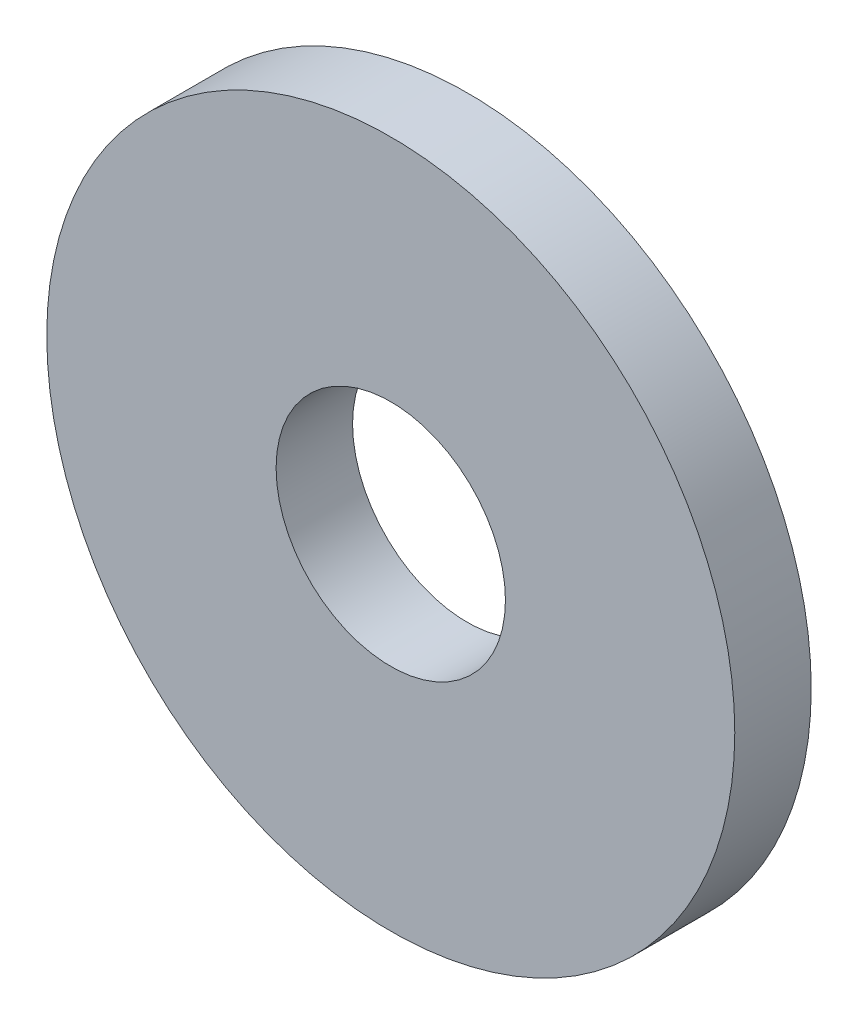
ISO-10303-21;
HEADER;
FILE_DESCRIPTION(('STEP AP214'),'2;1');
FILE_NAME('part.step','',(''),(''),'','','');
FILE_SCHEMA(('AUTOMOTIVE_DESIGN { 1 0 10303 214 1 1 1 1 }'));
ENDSEC;
DATA;
#1=APPLICATION_CONTEXT('core data for automotive mechanical design processes');
#2=APPLICATION_PROTOCOL_DEFINITION('international standard','automotive_design',2000,#1);
#3=PRODUCT_CONTEXT('',#1,'mechanical');
#4=PRODUCT('Part','Part','',(#3));
#5=PRODUCT_RELATED_PRODUCT_CATEGORY('part','',(#4));
#6=PRODUCT_DEFINITION_FORMATION('','',#4);
#7=PRODUCT_DEFINITION_CONTEXT('part definition',#1,'design');
#8=PRODUCT_DEFINITION('design','',#6,#7);
#9=PRODUCT_DEFINITION_SHAPE('','',#8);
#10=(LENGTH_UNIT() NAMED_UNIT(*) SI_UNIT(.MILLI.,.METRE.));
#11=(NAMED_UNIT(*) PLANE_ANGLE_UNIT() SI_UNIT($,.RADIAN.));
#12=(NAMED_UNIT(*) SI_UNIT($,.STERADIAN.) SOLID_ANGLE_UNIT());
#13=UNCERTAINTY_MEASURE_WITH_UNIT(LENGTH_MEASURE(1.E-05),#10,'distance_accuracy_value','');
#14=(GEOMETRIC_REPRESENTATION_CONTEXT(3) GLOBAL_UNCERTAINTY_ASSIGNED_CONTEXT((#13)) GLOBAL_UNIT_ASSIGNED_CONTEXT((#10,
#11,#12)) REPRESENTATION_CONTEXT('',''));
#15=CARTESIAN_POINT('',(0.,0.,0.));
#16=DIRECTION('',(0.,0.,1.));
#17=DIRECTION('',(1.,0.,0.));
#18=AXIS2_PLACEMENT_3D('',#15,#16,#17);
#19=CARTESIAN_POINT('',(0.,0.,0.5));
#20=DIRECTION('',(0.,0.,1.));
#21=DIRECTION('',(1.,0.,0.));
#22=AXIS2_PLACEMENT_3D('',#19,#20,#21);
#23=PLANE('',#22);
#24=CARTESIAN_POINT('',(0.,0.,0.5));
#25=DIRECTION('',(0.,0.,1.));
#26=DIRECTION('',(1.,0.,0.));
#27=AXIS2_PLACEMENT_3D('',#24,#25,#26);
#28=CIRCLE('',#27,2.25);
#29=CARTESIAN_POINT('',(2.25,0.,0.5));
#30=VERTEX_POINT('',#29);
#31=EDGE_CURVE('E10',#30,#30,#28,.T.);
#32=ORIENTED_EDGE('',*,*,#31,.T.);
#33=EDGE_LOOP('',(#32));
#34=FACE_BOUND('',#33,.T.);
#35=CARTESIAN_POINT('',(0.,0.,0.5));
#36=DIRECTION('',(0.,0.,1.));
#37=DIRECTION('',(1.,0.,0.));
#38=AXIS2_PLACEMENT_3D('',#35,#36,#37);
#39=CIRCLE('',#38,0.75);
#40=CARTESIAN_POINT('',(0.75,0.,0.5));
#41=VERTEX_POINT('',#40);
#42=EDGE_CURVE('E42',#41,#41,#39,.T.);
#43=ORIENTED_EDGE('',*,*,#42,.F.);
#44=EDGE_LOOP('',(#43));
#45=FACE_BOUND('',#44,.T.);
#46=ADVANCED_FACE('F31',(#34,#45),#23,.T.);
#47=CARTESIAN_POINT('',(0.,0.,0.));
#48=DIRECTION('',(0.,0.,1.));
#49=DIRECTION('',(1.,0.,0.));
#50=AXIS2_PLACEMENT_3D('',#47,#48,#49);
#51=PLANE('',#50);
#52=CARTESIAN_POINT('',(0.,0.,0.));
#53=DIRECTION('',(0.,0.,1.));
#54=DIRECTION('',(1.,0.,0.));
#55=AXIS2_PLACEMENT_3D('',#52,#53,#54);
#56=CIRCLE('',#55,2.25);
#57=CARTESIAN_POINT('',(2.25,0.,0.));
#58=VERTEX_POINT('',#57);
#59=EDGE_CURVE('E35',#58,#58,#56,.T.);
#60=ORIENTED_EDGE('',*,*,#59,.F.);
#61=EDGE_LOOP('',(#60));
#62=FACE_BOUND('',#61,.T.);
#63=CARTESIAN_POINT('',(0.,0.,0.));
#64=DIRECTION('',(0.,0.,1.));
#65=DIRECTION('',(1.,0.,0.));
#66=AXIS2_PLACEMENT_3D('',#63,#64,#65);
#67=CIRCLE('',#66,0.75);
#68=CARTESIAN_POINT('',(0.75,0.,0.));
#69=VERTEX_POINT('',#68);
#70=EDGE_CURVE('E44',#69,#69,#67,.T.);
#71=ORIENTED_EDGE('',*,*,#70,.T.);
#72=EDGE_LOOP('',(#71));
#73=FACE_BOUND('',#72,.T.);
#74=ADVANCED_FACE('F54',(#62,#73),#51,.F.);
#75=CARTESIAN_POINT('',(0.,0.,0.5));
#76=DIRECTION('',(0.,0.,-1.));
#77=DIRECTION('',(-1.,0.,0.));
#78=AXIS2_PLACEMENT_3D('',#75,#76,#77);
#79=CYLINDRICAL_SURFACE('',#78,2.25);
#80=ORIENTED_EDGE('',*,*,#31,.F.);
#81=EDGE_LOOP('',(#80));
#82=FACE_BOUND('',#81,.T.);
#83=ORIENTED_EDGE('',*,*,#59,.T.);
#84=EDGE_LOOP('',(#83));
#85=FACE_BOUND('',#84,.T.);
#86=ADVANCED_FACE('F33',(#82,#85),#79,.T.);
#87=CARTESIAN_POINT('',(0.,0.,0.5));
#88=DIRECTION('',(0.,0.,-1.));
#89=DIRECTION('',(-1.,0.,0.));
#90=AXIS2_PLACEMENT_3D('',#87,#88,#89);
#91=CYLINDRICAL_SURFACE('',#90,0.75);
#92=ORIENTED_EDGE('',*,*,#42,.T.);
#93=EDGE_LOOP('',(#92));
#94=FACE_BOUND('',#93,.T.);
#95=ORIENTED_EDGE('',*,*,#70,.F.);
#96=EDGE_LOOP('',(#95));
#97=FACE_BOUND('',#96,.T.);
#98=ADVANCED_FACE('F50',(#94,#97),#91,.F.);
#99=CLOSED_SHELL('',(#46,#74,#86,#98));
#100=MANIFOLD_SOLID_BREP('B2',#99);
#101=ADVANCED_BREP_SHAPE_REPRESENTATION('',(#18,#100),#14);
#102=SHAPE_DEFINITION_REPRESENTATION(#9,#101);
ENDSEC;
END-ISO-10303-21;
